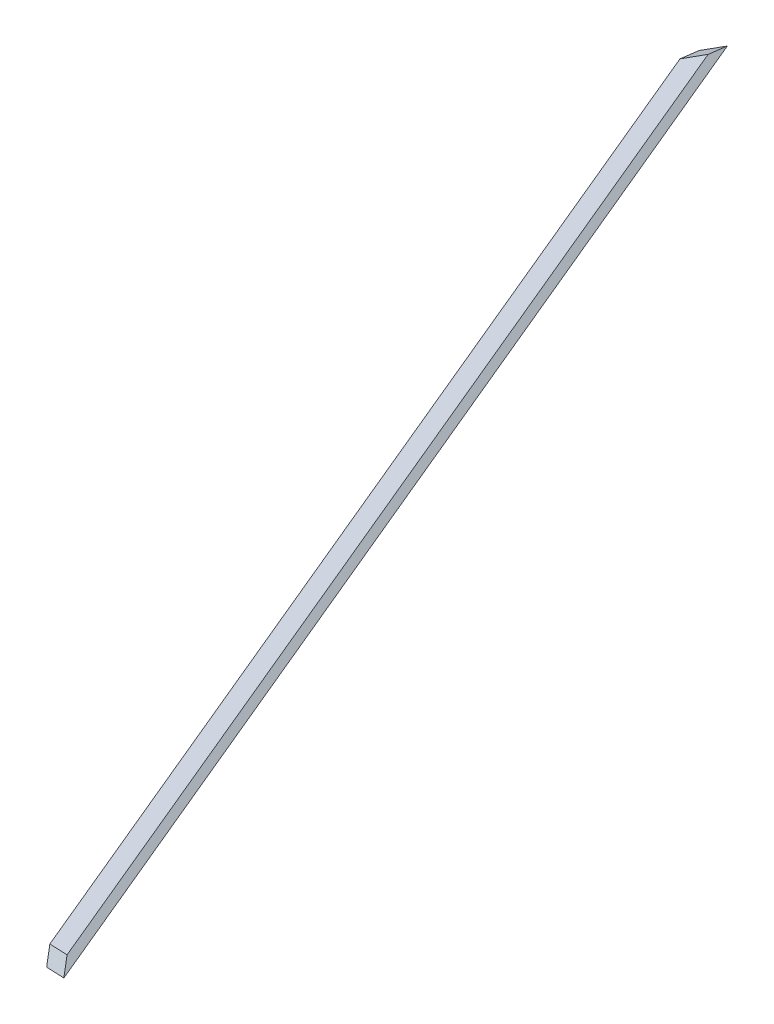
ISO-10303-21;
HEADER;
FILE_DESCRIPTION(('STEP AP214'),'2;1');
FILE_NAME('part.step','',(''),(''),'','','');
FILE_SCHEMA(('AUTOMOTIVE_DESIGN { 1 0 10303 214 1 1 1 1 }'));
ENDSEC;
DATA;
#1=APPLICATION_CONTEXT('core data for automotive mechanical design processes');
#2=APPLICATION_PROTOCOL_DEFINITION('international standard','automotive_design',2000,#1);
#3=PRODUCT_CONTEXT('',#1,'mechanical');
#4=PRODUCT('Part','Part','',(#3));
#5=PRODUCT_RELATED_PRODUCT_CATEGORY('part','',(#4));
#6=PRODUCT_DEFINITION_FORMATION('','',#4);
#7=PRODUCT_DEFINITION_CONTEXT('part definition',#1,'design');
#8=PRODUCT_DEFINITION('design','',#6,#7);
#9=PRODUCT_DEFINITION_SHAPE('','',#8);
#10=(LENGTH_UNIT() NAMED_UNIT(*) SI_UNIT(.MILLI.,.METRE.));
#11=(NAMED_UNIT(*) PLANE_ANGLE_UNIT() SI_UNIT($,.RADIAN.));
#12=(NAMED_UNIT(*) SI_UNIT($,.STERADIAN.) SOLID_ANGLE_UNIT());
#13=UNCERTAINTY_MEASURE_WITH_UNIT(LENGTH_MEASURE(1.E-05),#10,'distance_accuracy_value','');
#14=(GEOMETRIC_REPRESENTATION_CONTEXT(3) GLOBAL_UNCERTAINTY_ASSIGNED_CONTEXT((#13)) GLOBAL_UNIT_ASSIGNED_CONTEXT((#10,
#11,#12)) REPRESENTATION_CONTEXT('',''));
#15=CARTESIAN_POINT('',(0.,0.,0.));
#16=DIRECTION('',(0.,0.,1.));
#17=DIRECTION('',(1.,0.,0.));
#18=AXIS2_PLACEMENT_3D('',#15,#16,#17);
#19=CARTESIAN_POINT('',(-11.8087000621669,18.5032324543105,11.5952702361082));
#20=DIRECTION('',(0.475683661041611,-0.745355992499932,-0.467086179481358));
#21=DIRECTION('',(0.842960923517798,0.537974796270254,0.));
#22=AXIS2_PLACEMENT_3D('',#19,#20,#21);
#23=PLANE('',#22);
#24=DIRECTION('',(-0.0720568497783528,0.496206988023683,-0.865208896993371));
#25=VECTOR('',#24,1.);
#26=CARTESIAN_POINT('',(5350.15703681133,2089.60565194273,2167.28074516687));
#27=LINE('',#26,#25);
#28=CARTESIAN_POINT('',(5350.15703681133,2089.60565194273,2167.28074516688));
#29=VERTEX_POINT('',#28);
#30=CARTESIAN_POINT('',(5173.65713745217,3305.04157117592,47.9918265770702));
#31=VERTEX_POINT('',#30);
#32=EDGE_CURVE('E56',#29,#31,#27,.T.);
#33=ORIENTED_EDGE('',*,*,#32,.F.);
#34=DIRECTION('',(-0.872677996249967,-0.333333333333332,-0.356822089773086));
#35=VECTOR('',#34,1.);
#36=CARTESIAN_POINT('',(5439.97134003121,2123.91166309683,2204.00417294223));
#37=LINE('',#36,#35);
#38=CARTESIAN_POINT('',(5439.97134003121,2123.91166309683,2204.00417294223));
#39=VERTEX_POINT('',#38);
#40=EDGE_CURVE('E19',#39,#29,#37,.T.);
#41=ORIENTED_EDGE('',*,*,#40,.F.);
#42=DIRECTION('',(-0.0720568497783576,0.496206988023688,-0.865208896993367));
#43=VECTOR('',#42,1.);
#44=CARTESIAN_POINT('',(5439.97134003121,2123.91166309683,2204.00417294223));
#45=LINE('',#44,#43);
#46=CARTESIAN_POINT('',(5260.41301798619,3360.40887926034,47.9918265770703));
#47=VERTEX_POINT('',#46);
#48=EDGE_CURVE('E79',#39,#47,#45,.T.);
#49=ORIENTED_EDGE('',*,*,#48,.T.);
#50=DIRECTION('',(-0.842960923517797,-0.537974796270256,0.));
#51=VECTOR('',#50,1.);
#52=CARTESIAN_POINT('',(-1.46530917935236,2.29601532939744,47.9918265768255));
#53=LINE('',#52,#51);
#54=EDGE_CURVE('E54',#31,#47,#53,.F.);
#55=ORIENTED_EDGE('',*,*,#54,.F.);
#56=EDGE_LOOP('',(#33,#41,#49,#55));
#57=FACE_BOUND('',#56,.T.);
#58=ADVANCED_FACE('F16',(#57),#23,.F.);
#59=CARTESIAN_POINT('',(0.,0.,0.));
#60=DIRECTION('',(-0.467086179481353,0.356822089773098,0.809016994374947));
#61=DIRECTION('',(0.866025403784441,0.,0.499999999999996));
#62=AXIS2_PLACEMENT_3D('',#59,#60,#61);
#63=PLANE('',#62);
#64=ORIENTED_EDGE('',*,*,#40,.T.);
#65=DIRECTION('',(-0.34464694326967,0.7691229022656,-0.538208552241056));
#66=VECTOR('',#65,1.);
#67=CARTESIAN_POINT('',(5367.76786431786,2050.30488044998,2194.78221634237));
#68=LINE('',#67,#66);
#69=CARTESIAN_POINT('',(5367.76786431786,2050.30488044997,2194.78221634236));
#70=VERTEX_POINT('',#69);
#71=EDGE_CURVE('E62',#70,#29,#68,.T.);
#72=ORIENTED_EDGE('',*,*,#71,.F.);
#73=DIRECTION('',(-0.872677996249965,-0.333333333333335,-0.356822089773089));
#74=VECTOR('',#73,1.);
#75=CARTESIAN_POINT('',(5457.58216753774,2084.61089160408,2231.50564411773));
#76=LINE('',#75,#74);
#77=CARTESIAN_POINT('',(5457.58216753774,2084.61089160408,2231.50564411772));
#78=VERTEX_POINT('',#77);
#79=EDGE_CURVE('E82',#78,#70,#76,.T.);
#80=ORIENTED_EDGE('',*,*,#79,.F.);
#81=DIRECTION('',(-0.344646943269657,0.769122902265594,-0.538208552241073));
#82=VECTOR('',#81,1.);
#83=CARTESIAN_POINT('',(5457.58216753774,2084.61089160408,2231.50564411773));
#84=LINE('',#83,#82);
#85=EDGE_CURVE('E67',#78,#39,#84,.T.);
#86=ORIENTED_EDGE('',*,*,#85,.T.);
#87=EDGE_LOOP('',(#64,#72,#80,#86));
#88=FACE_BOUND('',#87,.T.);
#89=ADVANCED_FACE('F64',(#88),#63,.T.);
#90=CARTESIAN_POINT('',(4866.54819190921,3168.83947547108,1412.06610784528));
#91=DIRECTION('',(-0.814278199040255,-0.530215010595009,-0.23626903543946));
#92=DIRECTION('',(0.545664026406652,-0.838004039540192,0.));
#93=AXIS2_PLACEMENT_3D('',#90,#91,#92);
#94=PLANE('',#93);
#95=DIRECTION('',(-0.0720568497786003,0.496206988023978,-0.86520889699318));
#96=VECTOR('',#95,1.);
#97=CARTESIAN_POINT('',(5367.76786431786,2050.30488044998,2194.78221634237));
#98=LINE('',#97,#96);
#99=CARTESIAN_POINT('',(5184.9806865515,3309.03705105597,-1.34898141087069E-12));
#100=VERTEX_POINT('',#99);
#101=EDGE_CURVE('E71',#70,#100,#98,.T.);
#102=ORIENTED_EDGE('',*,*,#101,.F.);
#103=ORIENTED_EDGE('',*,*,#71,.T.);
#104=ORIENTED_EDGE('',*,*,#32,.T.);
#105=DIRECTION('',(-0.228891628224939,-0.0807637152780991,0.970095791570613));
#106=VECTOR('',#105,1.);
#107=CARTESIAN_POINT('',(5184.9806865515,3309.03705105598,-2.08296755212272E-12));
#108=LINE('',#107,#106);
#109=EDGE_CURVE('E74',#100,#31,#108,.T.);
#110=ORIENTED_EDGE('',*,*,#109,.F.);
#111=EDGE_LOOP('',(#102,#103,#104,#110));
#112=FACE_BOUND('',#111,.T.);
#113=ADVANCED_FACE('F69',(#112),#94,.T.);
#114=CARTESIAN_POINT('',(0.,0.,0.));
#115=DIRECTION('',(-0.537110456627946,0.841606576533205,-0.0566632836762697));
#116=DIRECTION('',(-0.842960923517797,-0.537974796270256,0.));
#117=AXIS2_PLACEMENT_3D('',#114,#115,#116);
#118=PLANE('',#117);
#119=DIRECTION('',(0.842960923517798,0.537974796270254,0.));
#120=VECTOR('',#119,1.);
#121=CARTESIAN_POINT('',(-3.31984145858711E-13,5.20191027770273E-13,-1.16819327497335E-12));
#122=LINE('',#121,#120);
#123=CARTESIAN_POINT('',(5271.73656708553,3364.4043591404,-2.28131542156009E-12));
#124=VERTEX_POINT('',#123);
#125=EDGE_CURVE('E25',#100,#124,#122,.T.);
#126=ORIENTED_EDGE('',*,*,#125,.F.);
#127=ORIENTED_EDGE('',*,*,#109,.T.);
#128=ORIENTED_EDGE('',*,*,#54,.T.);
#129=DIRECTION('',(0.228891628225174,0.0807637152777433,-0.970095791570588));
#130=VECTOR('',#129,1.);
#131=CARTESIAN_POINT('',(5260.41301798644,3360.40887925995,47.9918265768258));
#132=LINE('',#131,#130);
#133=EDGE_CURVE('E34',#47,#124,#132,.T.);
#134=ORIENTED_EDGE('',*,*,#133,.T.);
#135=EDGE_LOOP('',(#126,#127,#128,#134));
#136=FACE_BOUND('',#135,.T.);
#137=ADVANCED_FACE('F88',(#136),#118,.T.);
#138=CARTESIAN_POINT('',(4947.97601181323,3221.86097653058,1435.69301138923));
#139=DIRECTION('',(-0.814278199040255,-0.530215010595009,-0.23626903543946));
#140=DIRECTION('',(0.545664026406653,-0.838004039540192,0.));
#141=AXIS2_PLACEMENT_3D('',#138,#139,#140);
#142=PLANE('',#141);
#143=ORIENTED_EDGE('',*,*,#48,.F.);
#144=ORIENTED_EDGE('',*,*,#85,.F.);
#145=DIRECTION('',(0.0720568497785965,-0.49620698802398,0.86520889699318));
#146=VECTOR('',#145,1.);
#147=CARTESIAN_POINT('',(5271.73656708554,3364.40435914039,1.18039362374621E-12));
#148=LINE('',#147,#146);
#149=EDGE_CURVE('E11',#124,#78,#148,.T.);
#150=ORIENTED_EDGE('',*,*,#149,.F.);
#151=ORIENTED_EDGE('',*,*,#133,.F.);
#152=EDGE_LOOP('',(#143,#144,#150,#151));
#153=FACE_BOUND('',#152,.T.);
#154=ADVANCED_FACE('F90',(#153),#142,.F.);
#155=CARTESIAN_POINT('',(0.,0.,0.));
#156=DIRECTION('',(0.475683661041611,-0.745355992499932,-0.467086179481358));
#157=DIRECTION('',(0.842960923517798,0.537974796270254,0.));
#158=AXIS2_PLACEMENT_3D('',#155,#156,#157);
#159=PLANE('',#158);
#160=ORIENTED_EDGE('',*,*,#125,.T.);
#161=ORIENTED_EDGE('',*,*,#149,.T.);
#162=ORIENTED_EDGE('',*,*,#79,.T.);
#163=ORIENTED_EDGE('',*,*,#101,.T.);
#164=EDGE_LOOP('',(#160,#161,#162,#163));
#165=FACE_BOUND('',#164,.T.);
#166=ADVANCED_FACE('F87',(#165),#159,.T.);
#167=CLOSED_SHELL('',(#58,#89,#113,#137,#154,#166));
#168=MANIFOLD_SOLID_BREP('B1',#167);
#169=ADVANCED_BREP_SHAPE_REPRESENTATION('',(#18,#168),#14);
#170=SHAPE_DEFINITION_REPRESENTATION(#9,#169);
ENDSEC;
END-ISO-10303-21;
